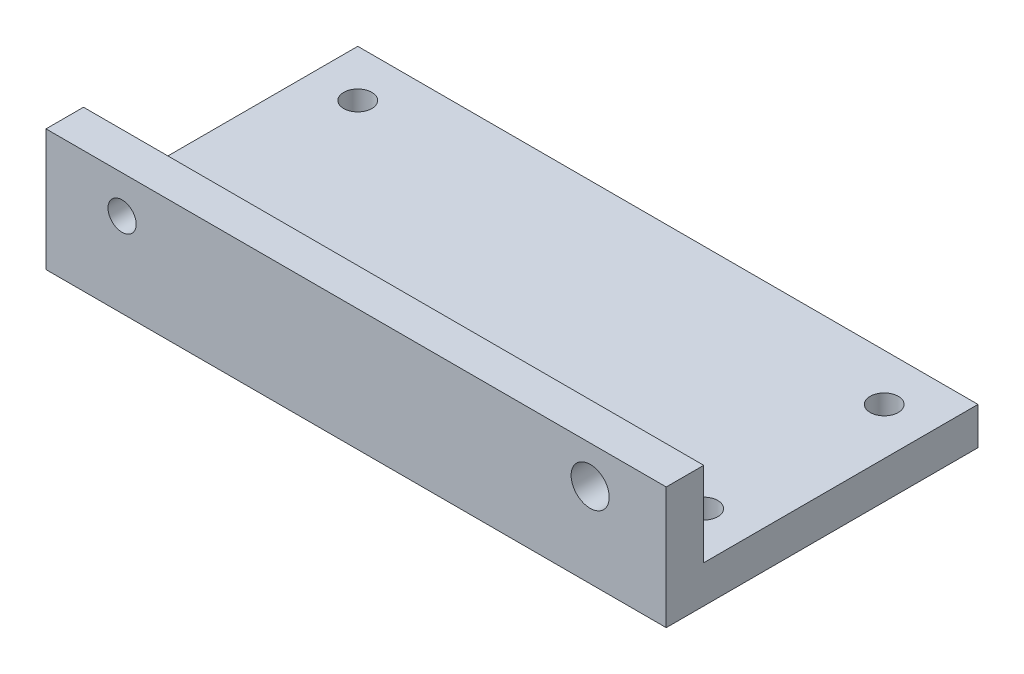
ISO-10303-21;
HEADER;
FILE_DESCRIPTION(('STEP AP214'),'2;1');
FILE_NAME('part.step','',(''),(''),'','','');
FILE_SCHEMA(('AUTOMOTIVE_DESIGN { 1 0 10303 214 1 1 1 1 }'));
ENDSEC;
DATA;
#1=APPLICATION_CONTEXT('core data for automotive mechanical design processes');
#2=APPLICATION_PROTOCOL_DEFINITION('international standard','automotive_design',2000,#1);
#3=PRODUCT_CONTEXT('',#1,'mechanical');
#4=PRODUCT('Part','Part','',(#3));
#5=PRODUCT_RELATED_PRODUCT_CATEGORY('part','',(#4));
#6=PRODUCT_DEFINITION_FORMATION('','',#4);
#7=PRODUCT_DEFINITION_CONTEXT('part definition',#1,'design');
#8=PRODUCT_DEFINITION('design','',#6,#7);
#9=PRODUCT_DEFINITION_SHAPE('','',#8);
#10=(LENGTH_UNIT() NAMED_UNIT(*) SI_UNIT(.MILLI.,.METRE.));
#11=(NAMED_UNIT(*) PLANE_ANGLE_UNIT() SI_UNIT($,.RADIAN.));
#12=(NAMED_UNIT(*) SI_UNIT($,.STERADIAN.) SOLID_ANGLE_UNIT());
#13=UNCERTAINTY_MEASURE_WITH_UNIT(LENGTH_MEASURE(1.E-05),#10,'distance_accuracy_value','');
#14=(GEOMETRIC_REPRESENTATION_CONTEXT(3) GLOBAL_UNCERTAINTY_ASSIGNED_CONTEXT((#13)) GLOBAL_UNIT_ASSIGNED_CONTEXT((#10,
#11,#12)) REPRESENTATION_CONTEXT('',''));
#15=CARTESIAN_POINT('',(0.,0.,0.));
#16=DIRECTION('',(0.,0.,1.));
#17=DIRECTION('',(1.,0.,0.));
#18=AXIS2_PLACEMENT_3D('',#15,#16,#17);
#19=CARTESIAN_POINT('',(0.,4.,18.625));
#20=DIRECTION('',(0.,0.,-1.));
#21=DIRECTION('',(-1.,0.,0.));
#22=AXIS2_PLACEMENT_3D('',#19,#20,#21);
#23=PLANE('',#22);
#24=CARTESIAN_POINT('',(-24.96,9.,18.625));
#25=DIRECTION('',(0.,0.,1.));
#26=DIRECTION('',(1.,0.,0.));
#27=AXIS2_PLACEMENT_3D('',#24,#25,#26);
#28=CIRCLE('',#27,1.5);
#29=CARTESIAN_POINT('',(-23.46,9.,18.625));
#30=VERTEX_POINT('',#29);
#31=EDGE_CURVE('E129',#30,#30,#28,.T.);
#32=ORIENTED_EDGE('',*,*,#31,.F.);
#33=EDGE_LOOP('',(#32));
#34=FACE_BOUND('',#33,.T.);
#35=CARTESIAN_POINT('',(24.96,9.,18.625));
#36=DIRECTION('',(0.,0.,1.));
#37=DIRECTION('',(1.,0.,0.));
#38=AXIS2_PLACEMENT_3D('',#35,#36,#37);
#39=CIRCLE('',#38,2.03112895342275);
#40=CARTESIAN_POINT('',(26.9911289534227,9.,18.625));
#41=VERTEX_POINT('',#40);
#42=EDGE_CURVE('E134',#41,#41,#39,.T.);
#43=ORIENTED_EDGE('',*,*,#42,.F.);
#44=EDGE_LOOP('',(#43));
#45=FACE_BOUND('',#44,.T.);
#46=DIRECTION('',(1.,0.,0.));
#47=VECTOR('',#46,1.);
#48=CARTESIAN_POINT('',(0.,0.,18.625));
#49=LINE('',#48,#47);
#50=CARTESIAN_POINT('',(-33.075,0.,18.625));
#51=VERTEX_POINT('',#50);
#52=CARTESIAN_POINT('',(33.075,0.,18.625));
#53=VERTEX_POINT('',#52);
#54=EDGE_CURVE('E95',#51,#53,#49,.T.);
#55=ORIENTED_EDGE('',*,*,#54,.T.);
#56=DIRECTION('',(0.,-1.,0.));
#57=VECTOR('',#56,1.);
#58=CARTESIAN_POINT('',(33.075,4.,18.625));
#59=LINE('',#58,#57);
#60=CARTESIAN_POINT('',(33.075,13.,18.625));
#61=VERTEX_POINT('',#60);
#62=EDGE_CURVE('E11',#61,#53,#59,.T.);
#63=ORIENTED_EDGE('',*,*,#62,.F.);
#64=DIRECTION('',(-1.,0.,0.));
#65=VECTOR('',#64,1.);
#66=CARTESIAN_POINT('',(0.,13.,18.625));
#67=LINE('',#66,#65);
#68=CARTESIAN_POINT('',(-33.075,13.,18.625));
#69=VERTEX_POINT('',#68);
#70=EDGE_CURVE('E97',#61,#69,#67,.T.);
#71=ORIENTED_EDGE('',*,*,#70,.T.);
#72=DIRECTION('',(0.,-1.,0.));
#73=VECTOR('',#72,1.);
#74=CARTESIAN_POINT('',(-33.075,4.,18.625));
#75=LINE('',#74,#73);
#76=EDGE_CURVE('E83',#69,#51,#75,.T.);
#77=ORIENTED_EDGE('',*,*,#76,.T.);
#78=EDGE_LOOP('',(#55,#63,#71,#77));
#79=FACE_BOUND('',#78,.T.);
#80=ADVANCED_FACE('F35',(#34,#45,#79),#23,.F.);
#81=CARTESIAN_POINT('',(33.075,4.,0.));
#82=DIRECTION('',(-1.,0.,0.));
#83=DIRECTION('',(0.,0.,1.));
#84=AXIS2_PLACEMENT_3D('',#81,#82,#83);
#85=PLANE('',#84);
#86=DIRECTION('',(0.,0.,-1.));
#87=VECTOR('',#86,1.);
#88=CARTESIAN_POINT('',(33.075,0.,0.));
#89=LINE('',#88,#87);
#90=CARTESIAN_POINT('',(33.075,0.,-14.625));
#91=VERTEX_POINT('',#90);
#92=EDGE_CURVE('E103',#53,#91,#89,.T.);
#93=ORIENTED_EDGE('',*,*,#92,.T.);
#94=DIRECTION('',(0.,-1.,0.));
#95=VECTOR('',#94,1.);
#96=CARTESIAN_POINT('',(33.075,4.,-14.625));
#97=LINE('',#96,#95);
#98=CARTESIAN_POINT('',(33.075,4.,-14.625));
#99=VERTEX_POINT('',#98);
#100=EDGE_CURVE('E43',#99,#91,#97,.T.);
#101=ORIENTED_EDGE('',*,*,#100,.F.);
#102=DIRECTION('',(0.,0.,-1.));
#103=VECTOR('',#102,1.);
#104=CARTESIAN_POINT('',(33.075,4.,0.));
#105=LINE('',#104,#103);
#106=CARTESIAN_POINT('',(33.075,4.,14.625));
#107=VERTEX_POINT('',#106);
#108=EDGE_CURVE('E124',#107,#99,#105,.T.);
#109=ORIENTED_EDGE('',*,*,#108,.F.);
#110=DIRECTION('',(0.,-1.,0.));
#111=VECTOR('',#110,1.);
#112=CARTESIAN_POINT('',(33.075,13.,14.625));
#113=LINE('',#112,#111);
#114=CARTESIAN_POINT('',(33.075,13.,14.625));
#115=VERTEX_POINT('',#114);
#116=EDGE_CURVE('E108',#115,#107,#113,.T.);
#117=ORIENTED_EDGE('',*,*,#116,.F.);
#118=DIRECTION('',(0.,0.,1.));
#119=VECTOR('',#118,1.);
#120=CARTESIAN_POINT('',(33.075,13.,0.));
#121=LINE('',#120,#119);
#122=EDGE_CURVE('E147',#115,#61,#121,.T.);
#123=ORIENTED_EDGE('',*,*,#122,.T.);
#124=ORIENTED_EDGE('',*,*,#62,.T.);
#125=EDGE_LOOP('',(#93,#101,#109,#117,#123,#124));
#126=FACE_BOUND('',#125,.T.);
#127=ADVANCED_FACE('F186',(#126),#85,.F.);
#128=CARTESIAN_POINT('',(0.,4.,-14.625));
#129=DIRECTION('',(0.,0.,-1.));
#130=DIRECTION('',(-1.,0.,0.));
#131=AXIS2_PLACEMENT_3D('',#128,#129,#130);
#132=PLANE('',#131);
#133=DIRECTION('',(1.,0.,0.));
#134=VECTOR('',#133,1.);
#135=CARTESIAN_POINT('',(0.,0.,-14.625));
#136=LINE('',#135,#134);
#137=CARTESIAN_POINT('',(-33.075,0.,-14.625));
#138=VERTEX_POINT('',#137);
#139=EDGE_CURVE('E89',#138,#91,#136,.T.);
#140=ORIENTED_EDGE('',*,*,#139,.F.);
#141=DIRECTION('',(0.,-1.,0.));
#142=VECTOR('',#141,1.);
#143=CARTESIAN_POINT('',(-33.075,4.,-14.625));
#144=LINE('',#143,#142);
#145=CARTESIAN_POINT('',(-33.075,4.,-14.625));
#146=VERTEX_POINT('',#145);
#147=EDGE_CURVE('E60',#146,#138,#144,.T.);
#148=ORIENTED_EDGE('',*,*,#147,.F.);
#149=DIRECTION('',(1.,0.,0.));
#150=VECTOR('',#149,1.);
#151=CARTESIAN_POINT('',(0.,4.,-14.625));
#152=LINE('',#151,#150);
#153=EDGE_CURVE('E154',#146,#99,#152,.T.);
#154=ORIENTED_EDGE('',*,*,#153,.T.);
#155=ORIENTED_EDGE('',*,*,#100,.T.);
#156=EDGE_LOOP('',(#140,#148,#154,#155));
#157=FACE_BOUND('',#156,.T.);
#158=ADVANCED_FACE('F191',(#157),#132,.T.);
#159=CARTESIAN_POINT('',(-28.075,4.,9.625));
#160=DIRECTION('',(0.,-1.,0.));
#161=DIRECTION('',(0.,0.,-1.));
#162=AXIS2_PLACEMENT_3D('',#159,#160,#161);
#163=CYLINDRICAL_SURFACE('',#162,1.5);
#164=CARTESIAN_POINT('',(-28.075,4.,9.625));
#165=DIRECTION('',(0.,1.,0.));
#166=DIRECTION('',(0.,0.,1.));
#167=AXIS2_PLACEMENT_3D('',#164,#165,#166);
#168=CIRCLE('',#167,1.5);
#169=CARTESIAN_POINT('',(-28.075,4.,11.125));
#170=VERTEX_POINT('',#169);
#171=EDGE_CURVE('E163',#170,#170,#168,.T.);
#172=ORIENTED_EDGE('',*,*,#171,.T.);
#173=EDGE_LOOP('',(#172));
#174=FACE_BOUND('',#173,.T.);
#175=CARTESIAN_POINT('',(-28.075,0.,9.625));
#176=DIRECTION('',(0.,1.,0.));
#177=DIRECTION('',(0.,0.,1.));
#178=AXIS2_PLACEMENT_3D('',#175,#176,#177);
#179=CIRCLE('',#178,1.5);
#180=CARTESIAN_POINT('',(-28.075,0.,11.125));
#181=VERTEX_POINT('',#180);
#182=EDGE_CURVE('E119',#181,#181,#179,.T.);
#183=ORIENTED_EDGE('',*,*,#182,.F.);
#184=EDGE_LOOP('',(#183));
#185=FACE_BOUND('',#184,.T.);
#186=ADVANCED_FACE('F229',(#174,#185),#163,.F.);
#187=CARTESIAN_POINT('',(28.075,4.,9.625));
#188=DIRECTION('',(0.,-1.,0.));
#189=DIRECTION('',(0.,0.,-1.));
#190=AXIS2_PLACEMENT_3D('',#187,#188,#189);
#191=CYLINDRICAL_SURFACE('',#190,1.5);
#192=CARTESIAN_POINT('',(28.075,4.,9.625));
#193=DIRECTION('',(0.,1.,0.));
#194=DIRECTION('',(0.,0.,1.));
#195=AXIS2_PLACEMENT_3D('',#192,#193,#194);
#196=CIRCLE('',#195,1.5);
#197=CARTESIAN_POINT('',(28.075,4.,11.125));
#198=VERTEX_POINT('',#197);
#199=EDGE_CURVE('E161',#198,#198,#196,.T.);
#200=ORIENTED_EDGE('',*,*,#199,.T.);
#201=EDGE_LOOP('',(#200));
#202=FACE_BOUND('',#201,.T.);
#203=CARTESIAN_POINT('',(28.075,0.,9.625));
#204=DIRECTION('',(0.,1.,0.));
#205=DIRECTION('',(0.,0.,1.));
#206=AXIS2_PLACEMENT_3D('',#203,#204,#205);
#207=CIRCLE('',#206,1.5);
#208=CARTESIAN_POINT('',(28.075,0.,11.125));
#209=VERTEX_POINT('',#208);
#210=EDGE_CURVE('E116',#209,#209,#207,.T.);
#211=ORIENTED_EDGE('',*,*,#210,.F.);
#212=EDGE_LOOP('',(#211));
#213=FACE_BOUND('',#212,.T.);
#214=ADVANCED_FACE('F234',(#202,#213),#191,.F.);
#215=CARTESIAN_POINT('',(28.075,4.,-9.625));
#216=DIRECTION('',(0.,-1.,0.));
#217=DIRECTION('',(0.,0.,-1.));
#218=AXIS2_PLACEMENT_3D('',#215,#216,#217);
#219=CYLINDRICAL_SURFACE('',#218,1.5);
#220=CARTESIAN_POINT('',(28.075,4.,-9.625));
#221=DIRECTION('',(0.,1.,0.));
#222=DIRECTION('',(0.,0.,1.));
#223=AXIS2_PLACEMENT_3D('',#220,#221,#222);
#224=CIRCLE('',#223,1.5);
#225=CARTESIAN_POINT('',(28.075,4.,-8.125));
#226=VERTEX_POINT('',#225);
#227=EDGE_CURVE('E158',#226,#226,#224,.T.);
#228=ORIENTED_EDGE('',*,*,#227,.T.);
#229=EDGE_LOOP('',(#228));
#230=FACE_BOUND('',#229,.T.);
#231=CARTESIAN_POINT('',(28.075,0.,-9.625));
#232=DIRECTION('',(0.,1.,0.));
#233=DIRECTION('',(0.,0.,1.));
#234=AXIS2_PLACEMENT_3D('',#231,#232,#233);
#235=CIRCLE('',#234,1.5);
#236=CARTESIAN_POINT('',(28.075,0.,-8.125));
#237=VERTEX_POINT('',#236);
#238=EDGE_CURVE('E88',#237,#237,#235,.T.);
#239=ORIENTED_EDGE('',*,*,#238,.F.);
#240=EDGE_LOOP('',(#239));
#241=FACE_BOUND('',#240,.T.);
#242=ADVANCED_FACE('F239',(#230,#241),#219,.F.);
#243=CARTESIAN_POINT('',(-33.075,4.,0.));
#244=DIRECTION('',(1.,0.,0.));
#245=DIRECTION('',(0.,0.,-1.));
#246=AXIS2_PLACEMENT_3D('',#243,#244,#245);
#247=PLANE('',#246);
#248=DIRECTION('',(0.,0.,1.));
#249=VECTOR('',#248,1.);
#250=CARTESIAN_POINT('',(-33.075,0.,0.));
#251=LINE('',#250,#249);
#252=EDGE_CURVE('E78',#138,#51,#251,.T.);
#253=ORIENTED_EDGE('',*,*,#252,.T.);
#254=ORIENTED_EDGE('',*,*,#76,.F.);
#255=DIRECTION('',(0.,0.,-1.));
#256=VECTOR('',#255,1.);
#257=CARTESIAN_POINT('',(-33.075,13.,0.));
#258=LINE('',#257,#256);
#259=CARTESIAN_POINT('',(-33.075,13.,14.625));
#260=VERTEX_POINT('',#259);
#261=EDGE_CURVE('E144',#69,#260,#258,.T.);
#262=ORIENTED_EDGE('',*,*,#261,.T.);
#263=DIRECTION('',(0.,-1.,0.));
#264=VECTOR('',#263,1.);
#265=CARTESIAN_POINT('',(-33.075,13.,14.625));
#266=LINE('',#265,#264);
#267=CARTESIAN_POINT('',(-33.075,4.,14.625));
#268=VERTEX_POINT('',#267);
#269=EDGE_CURVE('E104',#260,#268,#266,.T.);
#270=ORIENTED_EDGE('',*,*,#269,.T.);
#271=DIRECTION('',(0.,0.,1.));
#272=VECTOR('',#271,1.);
#273=CARTESIAN_POINT('',(-33.075,4.,0.));
#274=LINE('',#273,#272);
#275=EDGE_CURVE('E156',#146,#268,#274,.T.);
#276=ORIENTED_EDGE('',*,*,#275,.F.);
#277=ORIENTED_EDGE('',*,*,#147,.T.);
#278=EDGE_LOOP('',(#253,#254,#262,#270,#276,#277));
#279=FACE_BOUND('',#278,.T.);
#280=ADVANCED_FACE('F80',(#279),#247,.F.);
#281=CARTESIAN_POINT('',(-28.075,4.,-9.625));
#282=DIRECTION('',(0.,-1.,0.));
#283=DIRECTION('',(0.,0.,-1.));
#284=AXIS2_PLACEMENT_3D('',#281,#282,#283);
#285=CYLINDRICAL_SURFACE('',#284,1.5);
#286=CARTESIAN_POINT('',(-28.075,4.,-9.625));
#287=DIRECTION('',(0.,1.,0.));
#288=DIRECTION('',(0.,0.,1.));
#289=AXIS2_PLACEMENT_3D('',#286,#287,#288);
#290=CIRCLE('',#289,1.5);
#291=CARTESIAN_POINT('',(-28.075,4.,-8.125));
#292=VERTEX_POINT('',#291);
#293=EDGE_CURVE('E98',#292,#292,#290,.T.);
#294=ORIENTED_EDGE('',*,*,#293,.T.);
#295=EDGE_LOOP('',(#294));
#296=FACE_BOUND('',#295,.T.);
#297=CARTESIAN_POINT('',(-28.075,0.,-9.625));
#298=DIRECTION('',(0.,1.,0.));
#299=DIRECTION('',(0.,0.,1.));
#300=AXIS2_PLACEMENT_3D('',#297,#298,#299);
#301=CIRCLE('',#300,1.5);
#302=CARTESIAN_POINT('',(-28.075,0.,-8.125));
#303=VERTEX_POINT('',#302);
#304=EDGE_CURVE('E122',#303,#303,#301,.T.);
#305=ORIENTED_EDGE('',*,*,#304,.F.);
#306=EDGE_LOOP('',(#305));
#307=FACE_BOUND('',#306,.T.);
#308=ADVANCED_FACE('F170',(#296,#307),#285,.F.);
#309=CARTESIAN_POINT('',(0.,4.,0.));
#310=DIRECTION('',(0.,1.,0.));
#311=DIRECTION('',(0.,0.,1.));
#312=AXIS2_PLACEMENT_3D('',#309,#310,#311);
#313=PLANE('',#312);
#314=DIRECTION('',(-1.,0.,0.));
#315=VECTOR('',#314,1.);
#316=CARTESIAN_POINT('',(0.,4.,14.625));
#317=LINE('',#316,#315);
#318=EDGE_CURVE('E51',#107,#268,#317,.T.);
#319=ORIENTED_EDGE('',*,*,#318,.F.);
#320=ORIENTED_EDGE('',*,*,#108,.T.);
#321=ORIENTED_EDGE('',*,*,#153,.F.);
#322=ORIENTED_EDGE('',*,*,#275,.T.);
#323=EDGE_LOOP('',(#319,#320,#321,#322));
#324=FACE_BOUND('',#323,.T.);
#325=ORIENTED_EDGE('',*,*,#227,.F.);
#326=EDGE_LOOP('',(#325));
#327=FACE_BOUND('',#326,.T.);
#328=ORIENTED_EDGE('',*,*,#199,.F.);
#329=EDGE_LOOP('',(#328));
#330=FACE_BOUND('',#329,.T.);
#331=ORIENTED_EDGE('',*,*,#171,.F.);
#332=EDGE_LOOP('',(#331));
#333=FACE_BOUND('',#332,.T.);
#334=ORIENTED_EDGE('',*,*,#293,.F.);
#335=EDGE_LOOP('',(#334));
#336=FACE_BOUND('',#335,.T.);
#337=ADVANCED_FACE('F173',(#324,#327,#330,#333,#336),#313,.T.);
#338=CARTESIAN_POINT('',(0.,0.,0.));
#339=DIRECTION('',(0.,1.,0.));
#340=DIRECTION('',(0.,0.,1.));
#341=AXIS2_PLACEMENT_3D('',#338,#339,#340);
#342=PLANE('',#341);
#343=ORIENTED_EDGE('',*,*,#54,.F.);
#344=ORIENTED_EDGE('',*,*,#252,.F.);
#345=ORIENTED_EDGE('',*,*,#139,.T.);
#346=ORIENTED_EDGE('',*,*,#92,.F.);
#347=EDGE_LOOP('',(#343,#344,#345,#346));
#348=FACE_BOUND('',#347,.T.);
#349=ORIENTED_EDGE('',*,*,#238,.T.);
#350=EDGE_LOOP('',(#349));
#351=FACE_BOUND('',#350,.T.);
#352=ORIENTED_EDGE('',*,*,#210,.T.);
#353=EDGE_LOOP('',(#352));
#354=FACE_BOUND('',#353,.T.);
#355=ORIENTED_EDGE('',*,*,#182,.T.);
#356=EDGE_LOOP('',(#355));
#357=FACE_BOUND('',#356,.T.);
#358=ORIENTED_EDGE('',*,*,#304,.T.);
#359=EDGE_LOOP('',(#358));
#360=FACE_BOUND('',#359,.T.);
#361=ADVANCED_FACE('F100',(#348,#351,#354,#357,#360),#342,.F.);
#362=CARTESIAN_POINT('',(0.,13.,14.625));
#363=DIRECTION('',(0.,0.,1.));
#364=DIRECTION('',(1.,0.,0.));
#365=AXIS2_PLACEMENT_3D('',#362,#363,#364);
#366=PLANE('',#365);
#367=CARTESIAN_POINT('',(-24.96,9.,14.625));
#368=DIRECTION('',(0.,0.,1.));
#369=DIRECTION('',(1.,0.,0.));
#370=AXIS2_PLACEMENT_3D('',#367,#368,#369);
#371=CIRCLE('',#370,1.5);
#372=CARTESIAN_POINT('',(-23.46,9.,14.625));
#373=VERTEX_POINT('',#372);
#374=EDGE_CURVE('E38',#373,#373,#371,.T.);
#375=ORIENTED_EDGE('',*,*,#374,.T.);
#376=EDGE_LOOP('',(#375));
#377=FACE_BOUND('',#376,.T.);
#378=CARTESIAN_POINT('',(24.96,9.,14.625));
#379=DIRECTION('',(0.,0.,1.));
#380=DIRECTION('',(1.,0.,0.));
#381=AXIS2_PLACEMENT_3D('',#378,#379,#380);
#382=CIRCLE('',#381,2.03112895342275);
#383=CARTESIAN_POINT('',(26.9911289534227,9.,14.625));
#384=VERTEX_POINT('',#383);
#385=EDGE_CURVE('E127',#384,#384,#382,.T.);
#386=ORIENTED_EDGE('',*,*,#385,.T.);
#387=EDGE_LOOP('',(#386));
#388=FACE_BOUND('',#387,.T.);
#389=ORIENTED_EDGE('',*,*,#318,.T.);
#390=ORIENTED_EDGE('',*,*,#269,.F.);
#391=DIRECTION('',(-1.,0.,0.));
#392=VECTOR('',#391,1.);
#393=CARTESIAN_POINT('',(0.,13.,14.625));
#394=LINE('',#393,#392);
#395=EDGE_CURVE('E141',#115,#260,#394,.T.);
#396=ORIENTED_EDGE('',*,*,#395,.F.);
#397=ORIENTED_EDGE('',*,*,#116,.T.);
#398=EDGE_LOOP('',(#389,#390,#396,#397));
#399=FACE_BOUND('',#398,.T.);
#400=ADVANCED_FACE('F180',(#377,#388,#399),#366,.F.);
#401=CARTESIAN_POINT('',(0.,13.,0.));
#402=DIRECTION('',(0.,-1.,0.));
#403=DIRECTION('',(0.,0.,-1.));
#404=AXIS2_PLACEMENT_3D('',#401,#402,#403);
#405=PLANE('',#404);
#406=ORIENTED_EDGE('',*,*,#395,.T.);
#407=ORIENTED_EDGE('',*,*,#261,.F.);
#408=ORIENTED_EDGE('',*,*,#70,.F.);
#409=ORIENTED_EDGE('',*,*,#122,.F.);
#410=EDGE_LOOP('',(#406,#407,#408,#409));
#411=FACE_BOUND('',#410,.T.);
#412=ADVANCED_FACE('F200',(#411),#405,.F.);
#413=CARTESIAN_POINT('',(24.96,9.,9.625));
#414=DIRECTION('',(0.,0.,1.));
#415=DIRECTION('',(1.,0.,0.));
#416=AXIS2_PLACEMENT_3D('',#413,#414,#415);
#417=CYLINDRICAL_SURFACE('',#416,2.03112895342275);
#418=ORIENTED_EDGE('',*,*,#42,.T.);
#419=EDGE_LOOP('',(#418));
#420=FACE_BOUND('',#419,.T.);
#421=ORIENTED_EDGE('',*,*,#385,.F.);
#422=EDGE_LOOP('',(#421));
#423=FACE_BOUND('',#422,.T.);
#424=ADVANCED_FACE('F196',(#420,#423),#417,.F.);
#425=CARTESIAN_POINT('',(-24.96,9.,9.625));
#426=DIRECTION('',(0.,0.,1.));
#427=DIRECTION('',(1.,0.,0.));
#428=AXIS2_PLACEMENT_3D('',#425,#426,#427);
#429=CYLINDRICAL_SURFACE('',#428,1.5);
#430=ORIENTED_EDGE('',*,*,#31,.T.);
#431=EDGE_LOOP('',(#430));
#432=FACE_BOUND('',#431,.T.);
#433=ORIENTED_EDGE('',*,*,#374,.F.);
#434=EDGE_LOOP('',(#433));
#435=FACE_BOUND('',#434,.T.);
#436=ADVANCED_FACE('F199',(#432,#435),#429,.F.);
#437=CLOSED_SHELL('',(#80,#127,#158,#186,#214,#242,#280,#308,#337,#361,#400,#412,#424,#436));
#438=MANIFOLD_SOLID_BREP('B2',#437);
#439=ADVANCED_BREP_SHAPE_REPRESENTATION('',(#18,#438),#14);
#440=SHAPE_DEFINITION_REPRESENTATION(#9,#439);
ENDSEC;
END-ISO-10303-21;
